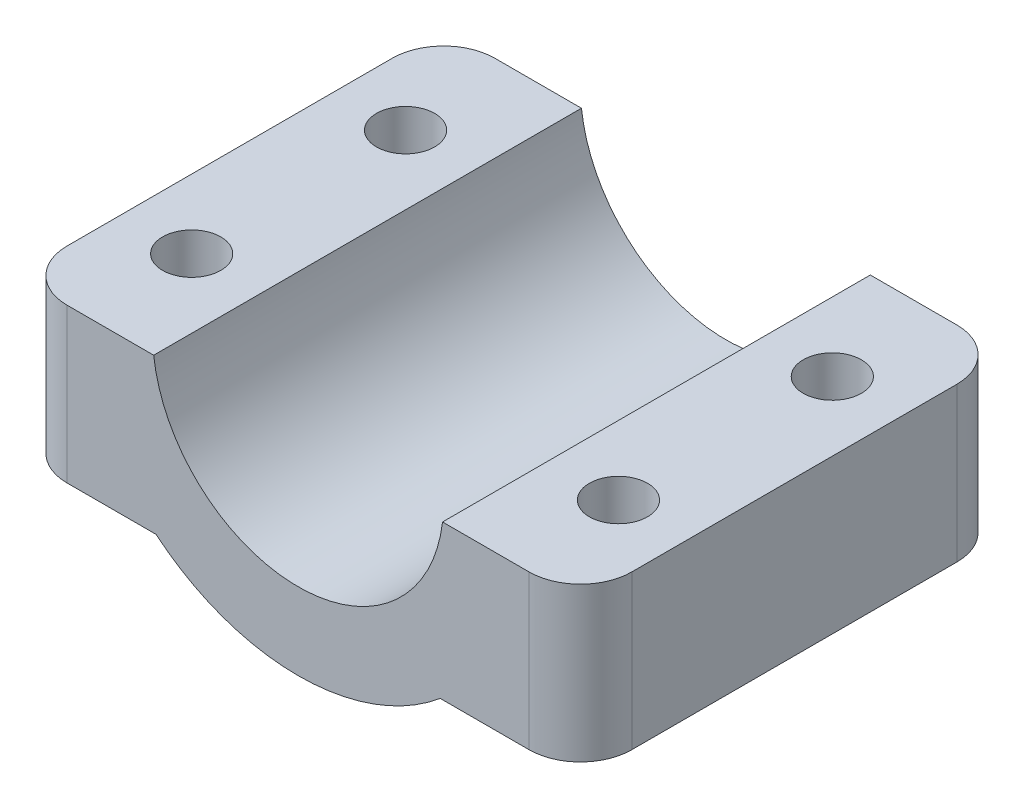
ISO-10303-21;
HEADER;
FILE_DESCRIPTION(('STEP AP214'),'2;1');
FILE_NAME('part.step','',(''),(''),'','','');
FILE_SCHEMA(('AUTOMOTIVE_DESIGN { 1 0 10303 214 1 1 1 1 }'));
ENDSEC;
DATA;
#1=APPLICATION_CONTEXT('core data for automotive mechanical design processes');
#2=APPLICATION_PROTOCOL_DEFINITION('international standard','automotive_design',2000,#1);
#3=PRODUCT_CONTEXT('',#1,'mechanical');
#4=PRODUCT('Part','Part','',(#3));
#5=PRODUCT_RELATED_PRODUCT_CATEGORY('part','',(#4));
#6=PRODUCT_DEFINITION_FORMATION('','',#4);
#7=PRODUCT_DEFINITION_CONTEXT('part definition',#1,'design');
#8=PRODUCT_DEFINITION('design','',#6,#7);
#9=PRODUCT_DEFINITION_SHAPE('','',#8);
#10=(LENGTH_UNIT() NAMED_UNIT(*) SI_UNIT(.MILLI.,.METRE.));
#11=(NAMED_UNIT(*) PLANE_ANGLE_UNIT() SI_UNIT($,.RADIAN.));
#12=(NAMED_UNIT(*) SI_UNIT($,.STERADIAN.) SOLID_ANGLE_UNIT());
#13=UNCERTAINTY_MEASURE_WITH_UNIT(LENGTH_MEASURE(1.E-05),#10,'distance_accuracy_value','');
#14=(GEOMETRIC_REPRESENTATION_CONTEXT(3) GLOBAL_UNCERTAINTY_ASSIGNED_CONTEXT((#13)) GLOBAL_UNIT_ASSIGNED_CONTEXT((#10,
#11,#12)) REPRESENTATION_CONTEXT('',''));
#15=CARTESIAN_POINT('',(0.,0.,0.));
#16=DIRECTION('',(0.,0.,1.));
#17=DIRECTION('',(1.,0.,0.));
#18=AXIS2_PLACEMENT_3D('',#15,#16,#17);
#19=CARTESIAN_POINT('',(12.4704857540335,-6.30832611206852,-6.25));
#20=DIRECTION('',(0.,1.,0.));
#21=DIRECTION('',(-1.,0.,0.));
#22=AXIS2_PLACEMENT_3D('',#19,#20,#21);
#23=CYLINDRICAL_SURFACE('',#22,1.7);
#24=CARTESIAN_POINT('',(12.4704857540335,7.5,-6.25));
#25=DIRECTION('',(0.,1.,0.));
#26=DIRECTION('',(1.,0.,0.));
#27=AXIS2_PLACEMENT_3D('',#24,#25,#26);
#28=CIRCLE('',#27,1.7);
#29=CARTESIAN_POINT('',(14.1704857540335,7.5,-6.25));
#30=VERTEX_POINT('',#29);
#31=EDGE_CURVE('E508',#30,#30,#28,.T.);
#32=ORIENTED_EDGE('',*,*,#31,.T.);
#33=EDGE_LOOP('',(#32));
#34=FACE_BOUND('',#33,.T.);
#35=CARTESIAN_POINT('',(12.4704857540335,1.5,-6.25));
#36=DIRECTION('',(0.,-1.,0.));
#37=DIRECTION('',(0.,0.,-1.));
#38=AXIS2_PLACEMENT_3D('',#35,#36,#37);
#39=CIRCLE('',#38,1.7);
#40=CARTESIAN_POINT('',(12.4704857540335,1.5,-7.95));
#41=VERTEX_POINT('',#40);
#42=EDGE_CURVE('E199',#41,#41,#39,.F.);
#43=ORIENTED_EDGE('',*,*,#42,.F.);
#44=EDGE_LOOP('',(#43));
#45=FACE_BOUND('',#44,.T.);
#46=ADVANCED_FACE('F33',(#34,#45),#23,.F.);
#47=CARTESIAN_POINT('',(-12.4704857540335,-6.30832611206852,6.25));
#48=DIRECTION('',(0.,1.,0.));
#49=DIRECTION('',(-1.,0.,0.));
#50=AXIS2_PLACEMENT_3D('',#47,#48,#49);
#51=CYLINDRICAL_SURFACE('',#50,1.7);
#52=CARTESIAN_POINT('',(-12.4704857540335,7.5,6.25));
#53=DIRECTION('',(0.,1.,0.));
#54=DIRECTION('',(1.,0.,0.));
#55=AXIS2_PLACEMENT_3D('',#52,#53,#54);
#56=CIRCLE('',#55,1.7);
#57=CARTESIAN_POINT('',(-10.7704857540335,7.5,6.25));
#58=VERTEX_POINT('',#57);
#59=EDGE_CURVE('E202',#58,#58,#56,.T.);
#60=ORIENTED_EDGE('',*,*,#59,.T.);
#61=EDGE_LOOP('',(#60));
#62=FACE_BOUND('',#61,.T.);
#63=CARTESIAN_POINT('',(-12.4704857540335,1.5,6.25));
#64=DIRECTION('',(0.,-1.,0.));
#65=DIRECTION('',(0.,0.,-1.));
#66=AXIS2_PLACEMENT_3D('',#63,#64,#65);
#67=CIRCLE('',#66,1.7);
#68=CARTESIAN_POINT('',(-12.4704857540335,1.5,4.55));
#69=VERTEX_POINT('',#68);
#70=EDGE_CURVE('E189',#69,#69,#67,.F.);
#71=ORIENTED_EDGE('',*,*,#70,.F.);
#72=EDGE_LOOP('',(#71));
#73=FACE_BOUND('',#72,.T.);
#74=ADVANCED_FACE('F280',(#62,#73),#51,.F.);
#75=CARTESIAN_POINT('',(16.5,-1.5,12.5));
#76=DIRECTION('',(-1.,0.,0.));
#77=DIRECTION('',(0.,0.,1.));
#78=AXIS2_PLACEMENT_3D('',#75,#76,#77);
#79=PLANE('',#78);
#80=DIRECTION('',(0.,0.,-1.));
#81=VECTOR('',#80,1.);
#82=CARTESIAN_POINT('',(16.5,-1.5,12.5));
#83=LINE('',#82,#81);
#84=CARTESIAN_POINT('',(16.5,-1.5,9.5));
#85=VERTEX_POINT('',#84);
#86=CARTESIAN_POINT('',(16.5,-1.5,-9.5));
#87=VERTEX_POINT('',#86);
#88=EDGE_CURVE('E160',#85,#87,#83,.T.);
#89=ORIENTED_EDGE('',*,*,#88,.T.);
#90=DIRECTION('',(0.,1.,0.));
#91=VECTOR('',#90,1.);
#92=CARTESIAN_POINT('',(16.5,-1.5,-9.5));
#93=LINE('',#92,#91);
#94=CARTESIAN_POINT('',(16.5,7.5,-9.5));
#95=VERTEX_POINT('',#94);
#96=EDGE_CURVE('E224',#87,#95,#93,.T.);
#97=ORIENTED_EDGE('',*,*,#96,.T.);
#98=DIRECTION('',(0.,0.,-1.));
#99=VECTOR('',#98,1.);
#100=CARTESIAN_POINT('',(16.5,7.5,12.5));
#101=LINE('',#100,#99);
#102=CARTESIAN_POINT('',(16.5,7.5,9.5));
#103=VERTEX_POINT('',#102);
#104=EDGE_CURVE('E143',#103,#95,#101,.T.);
#105=ORIENTED_EDGE('',*,*,#104,.F.);
#106=DIRECTION('',(0.,1.,0.));
#107=VECTOR('',#106,1.);
#108=CARTESIAN_POINT('',(16.5,-1.5,9.5));
#109=LINE('',#108,#107);
#110=EDGE_CURVE('E53',#103,#85,#109,.F.);
#111=ORIENTED_EDGE('',*,*,#110,.T.);
#112=EDGE_LOOP('',(#89,#97,#105,#111));
#113=FACE_BOUND('',#112,.T.);
#114=ADVANCED_FACE('F236',(#113),#79,.F.);
#115=CARTESIAN_POINT('',(8.44097150806707,7.5,12.5));
#116=DIRECTION('',(0.,-1.,0.));
#117=DIRECTION('',(1.,0.,0.));
#118=AXIS2_PLACEMENT_3D('',#115,#116,#117);
#119=PLANE('',#118);
#120=CARTESIAN_POINT('',(12.4704857540335,7.5,6.25));
#121=DIRECTION('',(0.,1.,0.));
#122=DIRECTION('',(-1.,0.,0.));
#123=AXIS2_PLACEMENT_3D('',#120,#121,#122);
#124=CIRCLE('',#123,1.7);
#125=CARTESIAN_POINT('',(10.7704857540335,7.5,6.25));
#126=VERTEX_POINT('',#125);
#127=EDGE_CURVE('E506',#126,#126,#124,.T.);
#128=ORIENTED_EDGE('',*,*,#127,.F.);
#129=EDGE_LOOP('',(#128));
#130=FACE_BOUND('',#129,.T.);
#131=ORIENTED_EDGE('',*,*,#31,.F.);
#132=EDGE_LOOP('',(#131));
#133=FACE_BOUND('',#132,.T.);
#134=ORIENTED_EDGE('',*,*,#104,.T.);
#135=CARTESIAN_POINT('',(13.5,7.5,-9.5));
#136=DIRECTION('',(0.,-1.,0.));
#137=DIRECTION('',(1.,0.,0.));
#138=AXIS2_PLACEMENT_3D('',#135,#136,#137);
#139=CIRCLE('',#138,3.);
#140=CARTESIAN_POINT('',(13.5,7.5,-12.5));
#141=VERTEX_POINT('',#140);
#142=EDGE_CURVE('E229',#95,#141,#139,.F.);
#143=ORIENTED_EDGE('',*,*,#142,.T.);
#144=DIRECTION('',(-1.,0.,0.));
#145=VECTOR('',#144,1.);
#146=CARTESIAN_POINT('',(8.44097150806707,7.5,-12.5));
#147=LINE('',#146,#145);
#148=CARTESIAN_POINT('',(8.44097150806707,7.5,-12.5));
#149=VERTEX_POINT('',#148);
#150=EDGE_CURVE('E140',#141,#149,#147,.T.);
#151=ORIENTED_EDGE('',*,*,#150,.T.);
#152=DIRECTION('',(0.,0.,-1.));
#153=VECTOR('',#152,1.);
#154=CARTESIAN_POINT('',(8.44097150806707,7.5,12.5));
#155=LINE('',#154,#153);
#156=CARTESIAN_POINT('',(8.44097150806707,7.5,12.5));
#157=VERTEX_POINT('',#156);
#158=EDGE_CURVE('E136',#157,#149,#155,.T.);
#159=ORIENTED_EDGE('',*,*,#158,.F.);
#160=DIRECTION('',(-1.,0.,0.));
#161=VECTOR('',#160,1.);
#162=CARTESIAN_POINT('',(8.44097150806707,7.5,12.5));
#163=LINE('',#162,#161);
#164=CARTESIAN_POINT('',(13.5,7.5,12.5));
#165=VERTEX_POINT('',#164);
#166=EDGE_CURVE('E122',#165,#157,#163,.T.);
#167=ORIENTED_EDGE('',*,*,#166,.F.);
#168=CARTESIAN_POINT('',(13.5,7.5,9.5));
#169=DIRECTION('',(0.,-1.,0.));
#170=DIRECTION('',(1.,0.,0.));
#171=AXIS2_PLACEMENT_3D('',#168,#169,#170);
#172=CIRCLE('',#171,3.);
#173=EDGE_CURVE('E227',#165,#103,#172,.F.);
#174=ORIENTED_EDGE('',*,*,#173,.T.);
#175=EDGE_LOOP('',(#134,#143,#151,#159,#167,#174));
#176=FACE_BOUND('',#175,.T.);
#177=ADVANCED_FACE('F138',(#130,#133,#176),#119,.F.);
#178=CARTESIAN_POINT('',(0.,8.5,12.5));
#179=DIRECTION('',(0.,0.,-1.));
#180=DIRECTION('',(-1.,0.,0.));
#181=AXIS2_PLACEMENT_3D('',#178,#179,#180);
#182=CYLINDRICAL_SURFACE('',#181,8.5);
#183=CARTESIAN_POINT('',(0.,8.5,-12.5));
#184=DIRECTION('',(0.,0.,-1.));
#185=DIRECTION('',(1.,0.,0.));
#186=AXIS2_PLACEMENT_3D('',#183,#184,#185);
#187=CIRCLE('',#186,8.5);
#188=CARTESIAN_POINT('',(-8.44097150806707,7.5,-12.5));
#189=VERTEX_POINT('',#188);
#190=EDGE_CURVE('E162',#149,#189,#187,.T.);
#191=ORIENTED_EDGE('',*,*,#190,.T.);
#192=DIRECTION('',(0.,0.,-1.));
#193=VECTOR('',#192,1.);
#194=CARTESIAN_POINT('',(-8.44097150806707,7.5,12.5));
#195=LINE('',#194,#193);
#196=CARTESIAN_POINT('',(-8.44097150806707,7.5,12.5));
#197=VERTEX_POINT('',#196);
#198=EDGE_CURVE('E144',#197,#189,#195,.T.);
#199=ORIENTED_EDGE('',*,*,#198,.F.);
#200=CARTESIAN_POINT('',(0.,8.5,12.5));
#201=DIRECTION('',(0.,0.,-1.));
#202=DIRECTION('',(1.,0.,0.));
#203=AXIS2_PLACEMENT_3D('',#200,#201,#202);
#204=CIRCLE('',#203,8.5);
#205=EDGE_CURVE('E127',#157,#197,#204,.T.);
#206=ORIENTED_EDGE('',*,*,#205,.F.);
#207=ORIENTED_EDGE('',*,*,#158,.T.);
#208=EDGE_LOOP('',(#191,#199,#206,#207));
#209=FACE_BOUND('',#208,.T.);
#210=ADVANCED_FACE('F146',(#209),#182,.F.);
#211=CARTESIAN_POINT('',(-16.5,7.5,12.5));
#212=DIRECTION('',(0.,-1.,0.));
#213=DIRECTION('',(1.,0.,0.));
#214=AXIS2_PLACEMENT_3D('',#211,#212,#213);
#215=PLANE('',#214);
#216=ORIENTED_EDGE('',*,*,#59,.F.);
#217=EDGE_LOOP('',(#216));
#218=FACE_BOUND('',#217,.T.);
#219=CARTESIAN_POINT('',(-12.4704857540335,7.5,-6.25));
#220=DIRECTION('',(0.,1.,0.));
#221=DIRECTION('',(-1.,0.,0.));
#222=AXIS2_PLACEMENT_3D('',#219,#220,#221);
#223=CIRCLE('',#222,1.7);
#224=CARTESIAN_POINT('',(-14.1704857540335,7.5,-6.25));
#225=VERTEX_POINT('',#224);
#226=EDGE_CURVE('E163',#225,#225,#223,.T.);
#227=ORIENTED_EDGE('',*,*,#226,.F.);
#228=EDGE_LOOP('',(#227));
#229=FACE_BOUND('',#228,.T.);
#230=DIRECTION('',(-1.,0.,0.));
#231=VECTOR('',#230,1.);
#232=CARTESIAN_POINT('',(-16.5,7.5,-12.5));
#233=LINE('',#232,#231);
#234=CARTESIAN_POINT('',(-13.5,7.5,-12.5));
#235=VERTEX_POINT('',#234);
#236=EDGE_CURVE('E165',#189,#235,#233,.T.);
#237=ORIENTED_EDGE('',*,*,#236,.T.);
#238=CARTESIAN_POINT('',(-13.5,7.5,-9.5));
#239=DIRECTION('',(0.,-1.,0.));
#240=DIRECTION('',(1.,0.,0.));
#241=AXIS2_PLACEMENT_3D('',#238,#239,#240);
#242=CIRCLE('',#241,3.);
#243=CARTESIAN_POINT('',(-16.5,7.5,-9.5));
#244=VERTEX_POINT('',#243);
#245=EDGE_CURVE('E217',#235,#244,#242,.F.);
#246=ORIENTED_EDGE('',*,*,#245,.T.);
#247=DIRECTION('',(0.,0.,-1.));
#248=VECTOR('',#247,1.);
#249=CARTESIAN_POINT('',(-16.5,7.5,12.5));
#250=LINE('',#249,#248);
#251=CARTESIAN_POINT('',(-16.5,7.5,9.5));
#252=VERTEX_POINT('',#251);
#253=EDGE_CURVE('E183',#252,#244,#250,.T.);
#254=ORIENTED_EDGE('',*,*,#253,.F.);
#255=CARTESIAN_POINT('',(-13.5,7.5,9.5));
#256=DIRECTION('',(0.,-1.,0.));
#257=DIRECTION('',(1.,0.,0.));
#258=AXIS2_PLACEMENT_3D('',#255,#256,#257);
#259=CIRCLE('',#258,3.);
#260=CARTESIAN_POINT('',(-13.5,7.5,12.5));
#261=VERTEX_POINT('',#260);
#262=EDGE_CURVE('E215',#252,#261,#259,.F.);
#263=ORIENTED_EDGE('',*,*,#262,.T.);
#264=DIRECTION('',(-1.,0.,0.));
#265=VECTOR('',#264,1.);
#266=CARTESIAN_POINT('',(-16.5,7.5,12.5));
#267=LINE('',#266,#265);
#268=EDGE_CURVE('E149',#197,#261,#267,.T.);
#269=ORIENTED_EDGE('',*,*,#268,.F.);
#270=ORIENTED_EDGE('',*,*,#198,.T.);
#271=EDGE_LOOP('',(#237,#246,#254,#263,#269,#270));
#272=FACE_BOUND('',#271,.T.);
#273=ADVANCED_FACE('F247',(#218,#229,#272),#215,.F.);
#274=CARTESIAN_POINT('',(-16.5,7.5,12.5));
#275=DIRECTION('',(1.,0.,0.));
#276=DIRECTION('',(0.,0.,-1.));
#277=AXIS2_PLACEMENT_3D('',#274,#275,#276);
#278=PLANE('',#277);
#279=ORIENTED_EDGE('',*,*,#253,.T.);
#280=DIRECTION('',(0.,-1.,0.));
#281=VECTOR('',#280,1.);
#282=CARTESIAN_POINT('',(-16.5,7.5,-9.5));
#283=LINE('',#282,#281);
#284=CARTESIAN_POINT('',(-16.5,-1.5,-9.5));
#285=VERTEX_POINT('',#284);
#286=EDGE_CURVE('E204',#244,#285,#283,.T.);
#287=ORIENTED_EDGE('',*,*,#286,.T.);
#288=DIRECTION('',(0.,0.,-1.));
#289=VECTOR('',#288,1.);
#290=CARTESIAN_POINT('',(-16.5,-1.5,12.5));
#291=LINE('',#290,#289);
#292=CARTESIAN_POINT('',(-16.5,-1.5,9.5));
#293=VERTEX_POINT('',#292);
#294=EDGE_CURVE('E180',#293,#285,#291,.T.);
#295=ORIENTED_EDGE('',*,*,#294,.F.);
#296=DIRECTION('',(0.,-1.,0.));
#297=VECTOR('',#296,1.);
#298=CARTESIAN_POINT('',(-16.5,7.5,9.5));
#299=LINE('',#298,#297);
#300=EDGE_CURVE('E188',#293,#252,#299,.F.);
#301=ORIENTED_EDGE('',*,*,#300,.T.);
#302=EDGE_LOOP('',(#279,#287,#295,#301));
#303=FACE_BOUND('',#302,.T.);
#304=ADVANCED_FACE('F261',(#303),#278,.F.);
#305=CARTESIAN_POINT('',(-16.5,-1.5,12.5));
#306=DIRECTION('',(0.,1.,0.));
#307=DIRECTION('',(0.,0.,1.));
#308=AXIS2_PLACEMENT_3D('',#305,#306,#307);
#309=PLANE('',#308);
#310=CARTESIAN_POINT('',(-12.4704857540335,-1.5,-6.25));
#311=DIRECTION('',(0.,-1.,0.));
#312=DIRECTION('',(0.,0.,1.));
#313=AXIS2_PLACEMENT_3D('',#310,#311,#312);
#314=CIRCLE('',#313,3.1);
#315=CARTESIAN_POINT('',(-12.4704857540335,-1.5,-3.15));
#316=VERTEX_POINT('',#315);
#317=EDGE_CURVE('E528',#316,#316,#314,.T.);
#318=ORIENTED_EDGE('',*,*,#317,.F.);
#319=EDGE_LOOP('',(#318));
#320=FACE_BOUND('',#319,.T.);
#321=CARTESIAN_POINT('',(-12.4704857540335,-1.5,6.25));
#322=DIRECTION('',(0.,-1.,0.));
#323=DIRECTION('',(0.,0.,-1.));
#324=AXIS2_PLACEMENT_3D('',#321,#322,#323);
#325=CIRCLE('',#324,3.1);
#326=CARTESIAN_POINT('',(-12.4704857540335,-1.5,3.15));
#327=VERTEX_POINT('',#326);
#328=EDGE_CURVE('E513',#327,#327,#325,.T.);
#329=ORIENTED_EDGE('',*,*,#328,.F.);
#330=EDGE_LOOP('',(#329));
#331=FACE_BOUND('',#330,.T.);
#332=ORIENTED_EDGE('',*,*,#294,.T.);
#333=CARTESIAN_POINT('',(-13.5,-1.5,-9.5));
#334=DIRECTION('',(0.,1.,0.));
#335=DIRECTION('',(0.,0.,1.));
#336=AXIS2_PLACEMENT_3D('',#333,#334,#335);
#337=CIRCLE('',#336,3.);
#338=CARTESIAN_POINT('',(-13.5,-1.5,-12.5));
#339=VERTEX_POINT('',#338);
#340=EDGE_CURVE('E209',#285,#339,#337,.F.);
#341=ORIENTED_EDGE('',*,*,#340,.T.);
#342=DIRECTION('',(1.,0.,0.));
#343=VECTOR('',#342,1.);
#344=CARTESIAN_POINT('',(-16.5,-1.5,-12.5));
#345=LINE('',#344,#343);
#346=CARTESIAN_POINT('',(-8.30662386291808,-1.5,-12.5));
#347=VERTEX_POINT('',#346);
#348=EDGE_CURVE('E168',#339,#347,#345,.T.);
#349=ORIENTED_EDGE('',*,*,#348,.T.);
#350=DIRECTION('',(0.,0.,-1.));
#351=VECTOR('',#350,1.);
#352=CARTESIAN_POINT('',(-8.30662386291808,-1.5,12.5));
#353=LINE('',#352,#351);
#354=CARTESIAN_POINT('',(-8.30662386291808,-1.5,12.5));
#355=VERTEX_POINT('',#354);
#356=EDGE_CURVE('E177',#355,#347,#353,.T.);
#357=ORIENTED_EDGE('',*,*,#356,.F.);
#358=DIRECTION('',(1.,0.,0.));
#359=VECTOR('',#358,1.);
#360=CARTESIAN_POINT('',(-16.5,-1.5,12.5));
#361=LINE('',#360,#359);
#362=CARTESIAN_POINT('',(-13.5,-1.5,12.5));
#363=VERTEX_POINT('',#362);
#364=EDGE_CURVE('E151',#363,#355,#361,.T.);
#365=ORIENTED_EDGE('',*,*,#364,.F.);
#366=CARTESIAN_POINT('',(-13.5,-1.5,9.5));
#367=DIRECTION('',(0.,1.,0.));
#368=DIRECTION('',(0.,0.,1.));
#369=AXIS2_PLACEMENT_3D('',#366,#367,#368);
#370=CIRCLE('',#369,3.);
#371=EDGE_CURVE('E207',#363,#293,#370,.F.);
#372=ORIENTED_EDGE('',*,*,#371,.T.);
#373=EDGE_LOOP('',(#332,#341,#349,#357,#365,#372));
#374=FACE_BOUND('',#373,.T.);
#375=ADVANCED_FACE('F258',(#320,#331,#374),#309,.F.);
#376=CARTESIAN_POINT('',(0.,8.5,12.5));
#377=DIRECTION('',(0.,0.,-1.));
#378=DIRECTION('',(-1.,0.,0.));
#379=AXIS2_PLACEMENT_3D('',#376,#377,#378);
#380=CYLINDRICAL_SURFACE('',#379,13.);
#381=CARTESIAN_POINT('',(0.,8.5,-12.5));
#382=DIRECTION('',(0.,0.,1.));
#383=DIRECTION('',(1.,0.,0.));
#384=AXIS2_PLACEMENT_3D('',#381,#382,#383);
#385=CIRCLE('',#384,13.);
#386=CARTESIAN_POINT('',(8.30662386291808,-1.5,-12.5));
#387=VERTEX_POINT('',#386);
#388=EDGE_CURVE('E170',#347,#387,#385,.T.);
#389=ORIENTED_EDGE('',*,*,#388,.T.);
#390=DIRECTION('',(0.,0.,-1.));
#391=VECTOR('',#390,1.);
#392=CARTESIAN_POINT('',(8.30662386291808,-1.5,12.5));
#393=LINE('',#392,#391);
#394=CARTESIAN_POINT('',(8.30662386291808,-1.5,12.5));
#395=VERTEX_POINT('',#394);
#396=EDGE_CURVE('E174',#395,#387,#393,.T.);
#397=ORIENTED_EDGE('',*,*,#396,.F.);
#398=CARTESIAN_POINT('',(0.,8.5,12.5));
#399=DIRECTION('',(0.,0.,1.));
#400=DIRECTION('',(1.,0.,0.));
#401=AXIS2_PLACEMENT_3D('',#398,#399,#400);
#402=CIRCLE('',#401,13.);
#403=EDGE_CURVE('E156',#355,#395,#402,.T.);
#404=ORIENTED_EDGE('',*,*,#403,.F.);
#405=ORIENTED_EDGE('',*,*,#356,.T.);
#406=EDGE_LOOP('',(#389,#397,#404,#405));
#407=FACE_BOUND('',#406,.T.);
#408=ADVANCED_FACE('F268',(#407),#380,.T.);
#409=CARTESIAN_POINT('',(8.30662386291808,-1.5,12.5));
#410=DIRECTION('',(0.,1.,0.));
#411=DIRECTION('',(0.,0.,1.));
#412=AXIS2_PLACEMENT_3D('',#409,#410,#411);
#413=PLANE('',#412);
#414=CARTESIAN_POINT('',(12.4704857540335,-1.5,-6.25));
#415=DIRECTION('',(0.,-1.,0.));
#416=DIRECTION('',(0.,0.,-1.));
#417=AXIS2_PLACEMENT_3D('',#414,#415,#416);
#418=CIRCLE('',#417,3.1);
#419=CARTESIAN_POINT('',(12.4704857540335,-1.5,-9.35));
#420=VERTEX_POINT('',#419);
#421=EDGE_CURVE('E534',#420,#420,#418,.T.);
#422=ORIENTED_EDGE('',*,*,#421,.F.);
#423=EDGE_LOOP('',(#422));
#424=FACE_BOUND('',#423,.T.);
#425=CARTESIAN_POINT('',(12.4704857540335,-1.5,6.25));
#426=DIRECTION('',(0.,-1.,0.));
#427=DIRECTION('',(0.,0.,1.));
#428=AXIS2_PLACEMENT_3D('',#425,#426,#427);
#429=CIRCLE('',#428,3.1);
#430=CARTESIAN_POINT('',(12.4704857540335,-1.5,9.35));
#431=VERTEX_POINT('',#430);
#432=EDGE_CURVE('E540',#431,#431,#429,.T.);
#433=ORIENTED_EDGE('',*,*,#432,.F.);
#434=EDGE_LOOP('',(#433));
#435=FACE_BOUND('',#434,.T.);
#436=DIRECTION('',(1.,0.,0.));
#437=VECTOR('',#436,1.);
#438=CARTESIAN_POINT('',(8.30662386291808,-1.5,-12.5));
#439=LINE('',#438,#437);
#440=CARTESIAN_POINT('',(13.5,-1.5,-12.5));
#441=VERTEX_POINT('',#440);
#442=EDGE_CURVE('E133',#387,#441,#439,.T.);
#443=ORIENTED_EDGE('',*,*,#442,.T.);
#444=CARTESIAN_POINT('',(13.5,-1.5,-9.5));
#445=DIRECTION('',(0.,1.,0.));
#446=DIRECTION('',(0.,0.,1.));
#447=AXIS2_PLACEMENT_3D('',#444,#445,#446);
#448=CIRCLE('',#447,3.);
#449=EDGE_CURVE('E11',#441,#87,#448,.F.);
#450=ORIENTED_EDGE('',*,*,#449,.T.);
#451=ORIENTED_EDGE('',*,*,#88,.F.);
#452=CARTESIAN_POINT('',(13.5,-1.5,9.5));
#453=DIRECTION('',(0.,1.,0.));
#454=DIRECTION('',(0.,0.,1.));
#455=AXIS2_PLACEMENT_3D('',#452,#453,#454);
#456=CIRCLE('',#455,3.);
#457=CARTESIAN_POINT('',(13.5,-1.5,12.5));
#458=VERTEX_POINT('',#457);
#459=EDGE_CURVE('E41',#85,#458,#456,.F.);
#460=ORIENTED_EDGE('',*,*,#459,.T.);
#461=DIRECTION('',(1.,0.,0.));
#462=VECTOR('',#461,1.);
#463=CARTESIAN_POINT('',(8.30662386291808,-1.5,12.5));
#464=LINE('',#463,#462);
#465=EDGE_CURVE('E158',#395,#458,#464,.T.);
#466=ORIENTED_EDGE('',*,*,#465,.F.);
#467=ORIENTED_EDGE('',*,*,#396,.T.);
#468=EDGE_LOOP('',(#443,#450,#451,#460,#466,#467));
#469=FACE_BOUND('',#468,.T.);
#470=ADVANCED_FACE('F232',(#424,#435,#469),#413,.F.);
#471=CARTESIAN_POINT('',(0.,8.5,12.5));
#472=DIRECTION('',(0.,0.,1.));
#473=DIRECTION('',(1.,0.,0.));
#474=AXIS2_PLACEMENT_3D('',#471,#472,#473);
#475=PLANE('',#474);
#476=ORIENTED_EDGE('',*,*,#268,.T.);
#477=DIRECTION('',(0.,-1.,0.));
#478=VECTOR('',#477,1.);
#479=CARTESIAN_POINT('',(-13.5,-1.5,12.5));
#480=LINE('',#479,#478);
#481=EDGE_CURVE('E220',#261,#363,#480,.T.);
#482=ORIENTED_EDGE('',*,*,#481,.T.);
#483=ORIENTED_EDGE('',*,*,#364,.T.);
#484=ORIENTED_EDGE('',*,*,#403,.T.);
#485=ORIENTED_EDGE('',*,*,#465,.T.);
#486=DIRECTION('',(0.,1.,0.));
#487=VECTOR('',#486,1.);
#488=CARTESIAN_POINT('',(13.5,7.5,12.5));
#489=LINE('',#488,#487);
#490=EDGE_CURVE('E131',#458,#165,#489,.T.);
#491=ORIENTED_EDGE('',*,*,#490,.T.);
#492=ORIENTED_EDGE('',*,*,#166,.T.);
#493=ORIENTED_EDGE('',*,*,#205,.T.);
#494=EDGE_LOOP('',(#476,#482,#483,#484,#485,#491,#492,#493));
#495=FACE_BOUND('',#494,.T.);
#496=ADVANCED_FACE('F125',(#495),#475,.T.);
#497=CARTESIAN_POINT('',(0.,8.5,-12.5));
#498=DIRECTION('',(0.,0.,1.));
#499=DIRECTION('',(1.,0.,0.));
#500=AXIS2_PLACEMENT_3D('',#497,#498,#499);
#501=PLANE('',#500);
#502=ORIENTED_EDGE('',*,*,#348,.F.);
#503=DIRECTION('',(0.,-1.,0.));
#504=VECTOR('',#503,1.);
#505=CARTESIAN_POINT('',(-13.5,8.5,-12.5));
#506=LINE('',#505,#504);
#507=EDGE_CURVE('E213',#339,#235,#506,.F.);
#508=ORIENTED_EDGE('',*,*,#507,.T.);
#509=ORIENTED_EDGE('',*,*,#236,.F.);
#510=ORIENTED_EDGE('',*,*,#190,.F.);
#511=ORIENTED_EDGE('',*,*,#150,.F.);
#512=DIRECTION('',(0.,1.,0.));
#513=VECTOR('',#512,1.);
#514=CARTESIAN_POINT('',(13.5,8.5,-12.5));
#515=LINE('',#514,#513);
#516=EDGE_CURVE('E211',#141,#441,#515,.F.);
#517=ORIENTED_EDGE('',*,*,#516,.T.);
#518=ORIENTED_EDGE('',*,*,#442,.F.);
#519=ORIENTED_EDGE('',*,*,#388,.F.);
#520=EDGE_LOOP('',(#502,#508,#509,#510,#511,#517,#518,#519));
#521=FACE_BOUND('',#520,.T.);
#522=ADVANCED_FACE('F243',(#521),#501,.F.);
#523=CARTESIAN_POINT('',(12.4704857540335,-6.30832611206852,6.25));
#524=DIRECTION('',(0.,1.,0.));
#525=DIRECTION('',(-1.,0.,0.));
#526=AXIS2_PLACEMENT_3D('',#523,#524,#525);
#527=CYLINDRICAL_SURFACE('',#526,1.7);
#528=CARTESIAN_POINT('',(12.4704857540335,1.5,6.25));
#529=DIRECTION('',(0.,1.,0.));
#530=DIRECTION('',(0.,0.,1.));
#531=AXIS2_PLACEMENT_3D('',#528,#529,#530);
#532=CIRCLE('',#531,1.7);
#533=CARTESIAN_POINT('',(12.4704857540335,1.5,7.95));
#534=VERTEX_POINT('',#533);
#535=EDGE_CURVE('E196',#534,#534,#532,.F.);
#536=ORIENTED_EDGE('',*,*,#535,.T.);
#537=EDGE_LOOP('',(#536));
#538=FACE_BOUND('',#537,.T.);
#539=ORIENTED_EDGE('',*,*,#127,.T.);
#540=EDGE_LOOP('',(#539));
#541=FACE_BOUND('',#540,.T.);
#542=ADVANCED_FACE('F294',(#538,#541),#527,.F.);
#543=CARTESIAN_POINT('',(-12.4704857540335,-6.30832611206852,-6.25));
#544=DIRECTION('',(0.,1.,0.));
#545=DIRECTION('',(-1.,0.,0.));
#546=AXIS2_PLACEMENT_3D('',#543,#544,#545);
#547=CYLINDRICAL_SURFACE('',#546,1.7);
#548=CARTESIAN_POINT('',(-12.4704857540335,1.5,-6.25));
#549=DIRECTION('',(0.,1.,0.));
#550=DIRECTION('',(0.,0.,1.));
#551=AXIS2_PLACEMENT_3D('',#548,#549,#550);
#552=CIRCLE('',#551,1.7);
#553=CARTESIAN_POINT('',(-12.4704857540335,1.5,-4.55));
#554=VERTEX_POINT('',#553);
#555=EDGE_CURVE('E192',#554,#554,#552,.F.);
#556=ORIENTED_EDGE('',*,*,#555,.T.);
#557=EDGE_LOOP('',(#556));
#558=FACE_BOUND('',#557,.T.);
#559=ORIENTED_EDGE('',*,*,#226,.T.);
#560=EDGE_LOOP('',(#559));
#561=FACE_BOUND('',#560,.T.);
#562=ADVANCED_FACE('F296',(#558,#561),#547,.F.);
#563=CARTESIAN_POINT('',(-12.4704857540335,1.5,6.25));
#564=DIRECTION('',(0.,-1.,0.));
#565=DIRECTION('',(0.,0.,-1.));
#566=AXIS2_PLACEMENT_3D('',#563,#564,#565);
#567=PLANE('',#566);
#568=CARTESIAN_POINT('',(-12.4704857540335,1.5,6.25));
#569=DIRECTION('',(0.,-1.,0.));
#570=DIRECTION('',(0.,0.,-1.));
#571=AXIS2_PLACEMENT_3D('',#568,#569,#570);
#572=CIRCLE('',#571,3.1);
#573=CARTESIAN_POINT('',(-12.4704857540335,1.5,3.15));
#574=VERTEX_POINT('',#573);
#575=EDGE_CURVE('E193',#574,#574,#572,.T.);
#576=ORIENTED_EDGE('',*,*,#575,.T.);
#577=EDGE_LOOP('',(#576));
#578=FACE_BOUND('',#577,.T.);
#579=ORIENTED_EDGE('',*,*,#70,.T.);
#580=EDGE_LOOP('',(#579));
#581=FACE_BOUND('',#580,.T.);
#582=ADVANCED_FACE('F301',(#578,#581),#567,.T.);
#583=CARTESIAN_POINT('',(-12.4704857540335,1.5,6.25));
#584=DIRECTION('',(0.,-1.,0.));
#585=DIRECTION('',(0.,0.,-1.));
#586=AXIS2_PLACEMENT_3D('',#583,#584,#585);
#587=CYLINDRICAL_SURFACE('',#586,3.1);
#588=ORIENTED_EDGE('',*,*,#575,.F.);
#589=EDGE_LOOP('',(#588));
#590=FACE_BOUND('',#589,.T.);
#591=ORIENTED_EDGE('',*,*,#328,.T.);
#592=EDGE_LOOP('',(#591));
#593=FACE_BOUND('',#592,.T.);
#594=ADVANCED_FACE('F292',(#590,#593),#587,.F.);
#595=CARTESIAN_POINT('',(-12.4704857540335,1.5,-6.25));
#596=DIRECTION('',(0.,1.,0.));
#597=DIRECTION('',(0.,0.,1.));
#598=AXIS2_PLACEMENT_3D('',#595,#596,#597);
#599=PLANE('',#598);
#600=CARTESIAN_POINT('',(-12.4704857540335,1.5,-6.25));
#601=DIRECTION('',(0.,-1.,0.));
#602=DIRECTION('',(0.,0.,1.));
#603=AXIS2_PLACEMENT_3D('',#600,#601,#602);
#604=CIRCLE('',#603,3.1);
#605=CARTESIAN_POINT('',(-12.4704857540335,1.5,-3.15));
#606=VERTEX_POINT('',#605);
#607=EDGE_CURVE('E531',#606,#606,#604,.T.);
#608=ORIENTED_EDGE('',*,*,#607,.T.);
#609=EDGE_LOOP('',(#608));
#610=FACE_BOUND('',#609,.T.);
#611=ORIENTED_EDGE('',*,*,#555,.F.);
#612=EDGE_LOOP('',(#611));
#613=FACE_BOUND('',#612,.T.);
#614=ADVANCED_FACE('F332',(#610,#613),#599,.F.);
#615=CARTESIAN_POINT('',(-12.4704857540335,1.5,-6.25));
#616=DIRECTION('',(0.,-1.,0.));
#617=DIRECTION('',(0.,0.,-1.));
#618=AXIS2_PLACEMENT_3D('',#615,#616,#617);
#619=CYLINDRICAL_SURFACE('',#618,3.1);
#620=ORIENTED_EDGE('',*,*,#607,.F.);
#621=EDGE_LOOP('',(#620));
#622=FACE_BOUND('',#621,.T.);
#623=ORIENTED_EDGE('',*,*,#317,.T.);
#624=EDGE_LOOP('',(#623));
#625=FACE_BOUND('',#624,.T.);
#626=ADVANCED_FACE('F339',(#622,#625),#619,.F.);
#627=CARTESIAN_POINT('',(12.4704857540335,1.5,6.25));
#628=DIRECTION('',(0.,1.,0.));
#629=DIRECTION('',(0.,0.,1.));
#630=AXIS2_PLACEMENT_3D('',#627,#628,#629);
#631=PLANE('',#630);
#632=CARTESIAN_POINT('',(12.4704857540335,1.5,6.25));
#633=DIRECTION('',(0.,-1.,0.));
#634=DIRECTION('',(0.,0.,1.));
#635=AXIS2_PLACEMENT_3D('',#632,#633,#634);
#636=CIRCLE('',#635,3.1);
#637=CARTESIAN_POINT('',(12.4704857540335,1.5,9.35));
#638=VERTEX_POINT('',#637);
#639=EDGE_CURVE('E525',#638,#638,#636,.T.);
#640=ORIENTED_EDGE('',*,*,#639,.T.);
#641=EDGE_LOOP('',(#640));
#642=FACE_BOUND('',#641,.T.);
#643=ORIENTED_EDGE('',*,*,#535,.F.);
#644=EDGE_LOOP('',(#643));
#645=FACE_BOUND('',#644,.T.);
#646=ADVANCED_FACE('F347',(#642,#645),#631,.F.);
#647=CARTESIAN_POINT('',(12.4704857540335,1.5,6.25));
#648=DIRECTION('',(0.,-1.,0.));
#649=DIRECTION('',(0.,0.,-1.));
#650=AXIS2_PLACEMENT_3D('',#647,#648,#649);
#651=CYLINDRICAL_SURFACE('',#650,3.1);
#652=ORIENTED_EDGE('',*,*,#639,.F.);
#653=EDGE_LOOP('',(#652));
#654=FACE_BOUND('',#653,.T.);
#655=ORIENTED_EDGE('',*,*,#432,.T.);
#656=EDGE_LOOP('',(#655));
#657=FACE_BOUND('',#656,.T.);
#658=ADVANCED_FACE('F355',(#654,#657),#651,.F.);
#659=CARTESIAN_POINT('',(12.4704857540335,1.5,-6.25));
#660=DIRECTION('',(0.,-1.,0.));
#661=DIRECTION('',(0.,0.,-1.));
#662=AXIS2_PLACEMENT_3D('',#659,#660,#661);
#663=PLANE('',#662);
#664=CARTESIAN_POINT('',(12.4704857540335,1.5,-6.25));
#665=DIRECTION('',(0.,-1.,0.));
#666=DIRECTION('',(0.,0.,-1.));
#667=AXIS2_PLACEMENT_3D('',#664,#665,#666);
#668=CIRCLE('',#667,3.1);
#669=CARTESIAN_POINT('',(12.4704857540335,1.5,-9.35));
#670=VERTEX_POINT('',#669);
#671=EDGE_CURVE('E537',#670,#670,#668,.T.);
#672=ORIENTED_EDGE('',*,*,#671,.T.);
#673=EDGE_LOOP('',(#672));
#674=FACE_BOUND('',#673,.T.);
#675=ORIENTED_EDGE('',*,*,#42,.T.);
#676=EDGE_LOOP('',(#675));
#677=FACE_BOUND('',#676,.T.);
#678=ADVANCED_FACE('F363',(#674,#677),#663,.T.);
#679=CARTESIAN_POINT('',(12.4704857540335,1.5,-6.25));
#680=DIRECTION('',(0.,-1.,0.));
#681=DIRECTION('',(0.,0.,-1.));
#682=AXIS2_PLACEMENT_3D('',#679,#680,#681);
#683=CYLINDRICAL_SURFACE('',#682,3.1);
#684=ORIENTED_EDGE('',*,*,#671,.F.);
#685=EDGE_LOOP('',(#684));
#686=FACE_BOUND('',#685,.T.);
#687=ORIENTED_EDGE('',*,*,#421,.T.);
#688=EDGE_LOOP('',(#687));
#689=FACE_BOUND('',#688,.T.);
#690=ADVANCED_FACE('F371',(#686,#689),#683,.F.);
#691=CARTESIAN_POINT('',(-13.5,7.5,-9.5));
#692=DIRECTION('',(0.,-1.,0.));
#693=DIRECTION('',(0.,0.,-1.));
#694=AXIS2_PLACEMENT_3D('',#691,#692,#693);
#695=CYLINDRICAL_SURFACE('',#694,3.);
#696=ORIENTED_EDGE('',*,*,#245,.F.);
#697=ORIENTED_EDGE('',*,*,#507,.F.);
#698=ORIENTED_EDGE('',*,*,#340,.F.);
#699=ORIENTED_EDGE('',*,*,#286,.F.);
#700=EDGE_LOOP('',(#696,#697,#698,#699));
#701=FACE_BOUND('',#700,.T.);
#702=ADVANCED_FACE('F264',(#701),#695,.T.);
#703=CARTESIAN_POINT('',(-13.5,8.5,9.5));
#704=DIRECTION('',(0.,1.,0.));
#705=DIRECTION('',(0.,0.,1.));
#706=AXIS2_PLACEMENT_3D('',#703,#704,#705);
#707=CYLINDRICAL_SURFACE('',#706,3.);
#708=ORIENTED_EDGE('',*,*,#262,.F.);
#709=ORIENTED_EDGE('',*,*,#300,.F.);
#710=ORIENTED_EDGE('',*,*,#371,.F.);
#711=ORIENTED_EDGE('',*,*,#481,.F.);
#712=EDGE_LOOP('',(#708,#709,#710,#711));
#713=FACE_BOUND('',#712,.T.);
#714=ADVANCED_FACE('F254',(#713),#707,.T.);
#715=CARTESIAN_POINT('',(13.5,-1.5,-9.5));
#716=DIRECTION('',(0.,1.,0.));
#717=DIRECTION('',(0.,0.,1.));
#718=AXIS2_PLACEMENT_3D('',#715,#716,#717);
#719=CYLINDRICAL_SURFACE('',#718,3.);
#720=ORIENTED_EDGE('',*,*,#449,.F.);
#721=ORIENTED_EDGE('',*,*,#516,.F.);
#722=ORIENTED_EDGE('',*,*,#142,.F.);
#723=ORIENTED_EDGE('',*,*,#96,.F.);
#724=EDGE_LOOP('',(#720,#721,#722,#723));
#725=FACE_BOUND('',#724,.T.);
#726=ADVANCED_FACE('F239',(#725),#719,.T.);
#727=CARTESIAN_POINT('',(13.5,8.5,9.5));
#728=DIRECTION('',(0.,-1.,0.));
#729=DIRECTION('',(0.,0.,-1.));
#730=AXIS2_PLACEMENT_3D('',#727,#728,#729);
#731=CYLINDRICAL_SURFACE('',#730,3.);
#732=ORIENTED_EDGE('',*,*,#459,.F.);
#733=ORIENTED_EDGE('',*,*,#110,.F.);
#734=ORIENTED_EDGE('',*,*,#173,.F.);
#735=ORIENTED_EDGE('',*,*,#490,.F.);
#736=EDGE_LOOP('',(#732,#733,#734,#735));
#737=FACE_BOUND('',#736,.T.);
#738=ADVANCED_FACE('F35',(#737),#731,.T.);
#739=CLOSED_SHELL('',(#46,#74,#114,#177,#210,#273,#304,#375,#408,#470,#496,#522,#542,#562,#582,
#594,#614,#626,#646,#658,#678,#690,#702,#714,#726,#738));
#740=MANIFOLD_SOLID_BREP('B2',#739);
#741=ADVANCED_BREP_SHAPE_REPRESENTATION('',(#18,#740),#14);
#742=SHAPE_DEFINITION_REPRESENTATION(#9,#741);
ENDSEC;
END-ISO-10303-21;
